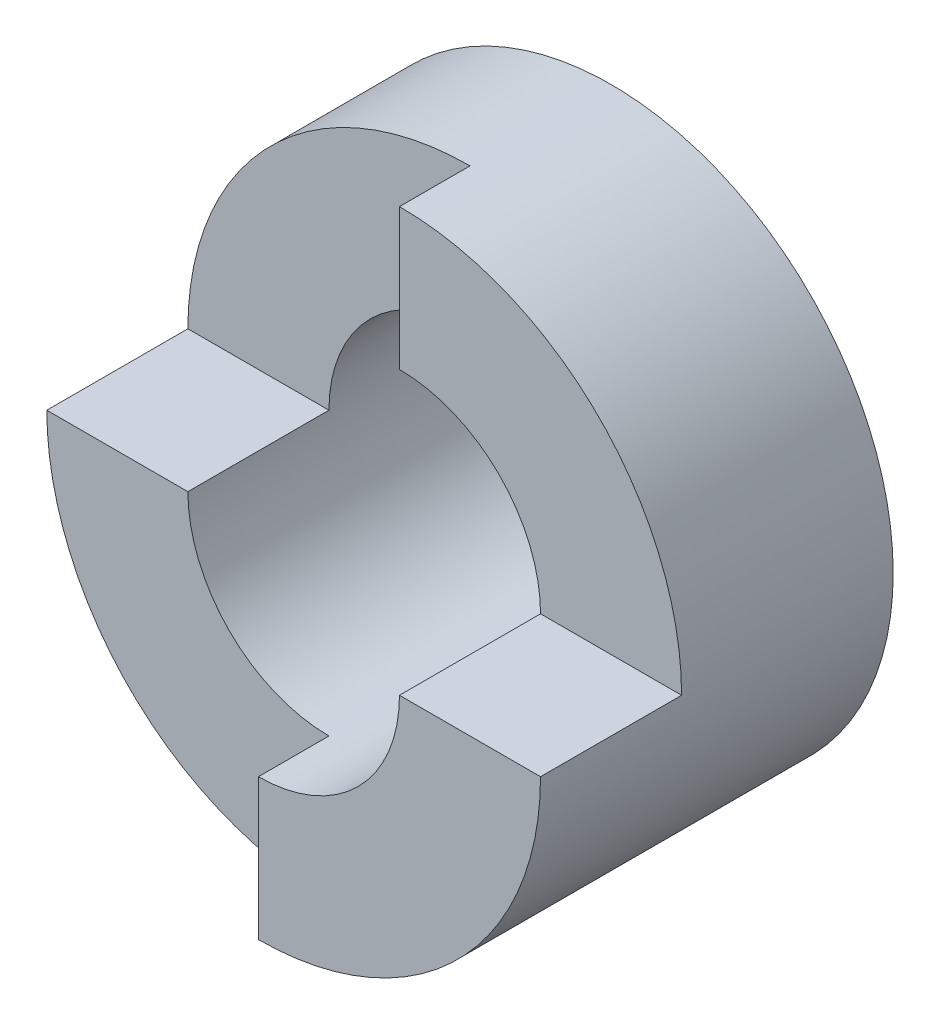
ISO-10303-21;
HEADER;
FILE_DESCRIPTION(('STEP AP214'),'2;1');
FILE_NAME('part.step','',(''),(''),'','','');
FILE_SCHEMA(('AUTOMOTIVE_DESIGN { 1 0 10303 214 1 1 1 1 }'));
ENDSEC;
DATA;
#1=APPLICATION_CONTEXT('core data for automotive mechanical design processes');
#2=APPLICATION_PROTOCOL_DEFINITION('international standard','automotive_design',2000,#1);
#3=PRODUCT_CONTEXT('',#1,'mechanical');
#4=PRODUCT('Part','Part','',(#3));
#5=PRODUCT_RELATED_PRODUCT_CATEGORY('part','',(#4));
#6=PRODUCT_DEFINITION_FORMATION('','',#4);
#7=PRODUCT_DEFINITION_CONTEXT('part definition',#1,'design');
#8=PRODUCT_DEFINITION('design','',#6,#7);
#9=PRODUCT_DEFINITION_SHAPE('','',#8);
#10=(LENGTH_UNIT() NAMED_UNIT(*) SI_UNIT(.MILLI.,.METRE.));
#11=(NAMED_UNIT(*) PLANE_ANGLE_UNIT() SI_UNIT($,.RADIAN.));
#12=(NAMED_UNIT(*) SI_UNIT($,.STERADIAN.) SOLID_ANGLE_UNIT());
#13=UNCERTAINTY_MEASURE_WITH_UNIT(LENGTH_MEASURE(1.E-05),#10,'distance_accuracy_value','');
#14=(GEOMETRIC_REPRESENTATION_CONTEXT(3) GLOBAL_UNCERTAINTY_ASSIGNED_CONTEXT((#13)) GLOBAL_UNIT_ASSIGNED_CONTEXT((#10,
#11,#12)) REPRESENTATION_CONTEXT('',''));
#15=CARTESIAN_POINT('',(0.,0.,0.));
#16=DIRECTION('',(0.,0.,1.));
#17=DIRECTION('',(1.,0.,0.));
#18=AXIS2_PLACEMENT_3D('',#15,#16,#17);
#19=CARTESIAN_POINT('',(0.,0.,5.));
#20=DIRECTION('',(0.,0.,1.));
#21=DIRECTION('',(1.,0.,0.));
#22=AXIS2_PLACEMENT_3D('',#19,#20,#21);
#23=PLANE('',#22);
#24=DIRECTION('',(0.,1.,0.));
#25=VECTOR('',#24,1.);
#26=CARTESIAN_POINT('',(0.,-5.,5.));
#27=LINE('',#26,#25);
#28=CARTESIAN_POINT('',(0.,-4.,5.));
#29=VERTEX_POINT('',#28);
#30=CARTESIAN_POINT('',(0.,-2.,5.));
#31=VERTEX_POINT('',#30);
#32=EDGE_CURVE('E180',#29,#31,#27,.T.);
#33=ORIENTED_EDGE('',*,*,#32,.F.);
#34=CARTESIAN_POINT('',(0.,0.,5.));
#35=DIRECTION('',(0.,0.,1.));
#36=DIRECTION('',(1.,0.,0.));
#37=AXIS2_PLACEMENT_3D('',#34,#35,#36);
#38=CIRCLE('',#37,4.);
#39=CARTESIAN_POINT('',(4.,0.,5.));
#40=VERTEX_POINT('',#39);
#41=EDGE_CURVE('E145',#29,#40,#38,.T.);
#42=ORIENTED_EDGE('',*,*,#41,.T.);
#43=DIRECTION('',(1.,0.,0.));
#44=VECTOR('',#43,1.);
#45=CARTESIAN_POINT('',(4.,0.,5.));
#46=LINE('',#45,#44);
#47=CARTESIAN_POINT('',(2.,0.,5.));
#48=VERTEX_POINT('',#47);
#49=EDGE_CURVE('E117',#48,#40,#46,.T.);
#50=ORIENTED_EDGE('',*,*,#49,.F.);
#51=CARTESIAN_POINT('',(0.,0.,5.));
#52=DIRECTION('',(0.,0.,1.));
#53=DIRECTION('',(1.,0.,0.));
#54=AXIS2_PLACEMENT_3D('',#51,#52,#53);
#55=CIRCLE('',#54,2.);
#56=EDGE_CURVE('E140',#31,#48,#55,.T.);
#57=ORIENTED_EDGE('',*,*,#56,.F.);
#58=EDGE_LOOP('',(#33,#42,#50,#57));
#59=FACE_BOUND('',#58,.T.);
#60=ADVANCED_FACE('F33',(#59),#23,.T.);
#61=CARTESIAN_POINT('',(0.,0.,0.));
#62=DIRECTION('',(0.,0.,1.));
#63=DIRECTION('',(1.,0.,0.));
#64=AXIS2_PLACEMENT_3D('',#61,#62,#63);
#65=PLANE('',#64);
#66=CARTESIAN_POINT('',(0.,0.,0.));
#67=DIRECTION('',(0.,0.,1.));
#68=DIRECTION('',(1.,0.,0.));
#69=AXIS2_PLACEMENT_3D('',#66,#67,#68);
#70=CIRCLE('',#69,4.);
#71=CARTESIAN_POINT('',(4.,0.,0.));
#72=VERTEX_POINT('',#71);
#73=EDGE_CURVE('E142',#72,#72,#70,.T.);
#74=ORIENTED_EDGE('',*,*,#73,.F.);
#75=EDGE_LOOP('',(#74));
#76=FACE_BOUND('',#75,.T.);
#77=CARTESIAN_POINT('',(0.,0.,0.));
#78=DIRECTION('',(0.,0.,1.));
#79=DIRECTION('',(1.,0.,0.));
#80=AXIS2_PLACEMENT_3D('',#77,#78,#79);
#81=CIRCLE('',#80,2.);
#82=CARTESIAN_POINT('',(2.,0.,0.));
#83=VERTEX_POINT('',#82);
#84=EDGE_CURVE('E139',#83,#83,#81,.T.);
#85=ORIENTED_EDGE('',*,*,#84,.T.);
#86=EDGE_LOOP('',(#85));
#87=FACE_BOUND('',#86,.T.);
#88=ADVANCED_FACE('F197',(#76,#87),#65,.F.);
#89=CARTESIAN_POINT('',(0.,0.,5.));
#90=DIRECTION('',(0.,0.,-1.));
#91=DIRECTION('',(-1.,0.,0.));
#92=AXIS2_PLACEMENT_3D('',#89,#90,#91);
#93=CYLINDRICAL_SURFACE('',#92,4.);
#94=DIRECTION('',(0.,0.,-1.));
#95=VECTOR('',#94,1.);
#96=CARTESIAN_POINT('',(0.,-4.,5.));
#97=LINE('',#96,#95);
#98=CARTESIAN_POINT('',(0.,-4.,4.));
#99=VERTEX_POINT('',#98);
#100=EDGE_CURVE('E111',#29,#99,#97,.T.);
#101=ORIENTED_EDGE('',*,*,#100,.T.);
#102=CARTESIAN_POINT('',(0.,0.,4.));
#103=DIRECTION('',(0.,0.,-1.));
#104=DIRECTION('',(-1.,0.,0.));
#105=AXIS2_PLACEMENT_3D('',#102,#103,#104);
#106=CIRCLE('',#105,4.);
#107=CARTESIAN_POINT('',(-4.,0.,4.));
#108=VERTEX_POINT('',#107);
#109=EDGE_CURVE('E98',#99,#108,#106,.T.);
#110=ORIENTED_EDGE('',*,*,#109,.T.);
#111=DIRECTION('',(0.,0.,1.));
#112=VECTOR('',#111,1.);
#113=CARTESIAN_POINT('',(-4.,0.,5.));
#114=LINE('',#113,#112);
#115=CARTESIAN_POINT('',(-4.,0.,2.));
#116=VERTEX_POINT('',#115);
#117=EDGE_CURVE('E109',#116,#108,#114,.T.);
#118=ORIENTED_EDGE('',*,*,#117,.F.);
#119=CARTESIAN_POINT('',(0.,0.,2.));
#120=DIRECTION('',(0.,0.,1.));
#121=DIRECTION('',(1.,0.,0.));
#122=AXIS2_PLACEMENT_3D('',#119,#120,#121);
#123=CIRCLE('',#122,4.);
#124=CARTESIAN_POINT('',(0.,4.,2.));
#125=VERTEX_POINT('',#124);
#126=EDGE_CURVE('E133',#125,#116,#123,.T.);
#127=ORIENTED_EDGE('',*,*,#126,.F.);
#128=DIRECTION('',(0.,0.,-1.));
#129=VECTOR('',#128,1.);
#130=CARTESIAN_POINT('',(0.,4.,5.));
#131=LINE('',#130,#129);
#132=CARTESIAN_POINT('',(0.,4.,3.));
#133=VERTEX_POINT('',#132);
#134=EDGE_CURVE('E135',#133,#125,#131,.T.);
#135=ORIENTED_EDGE('',*,*,#134,.F.);
#136=CARTESIAN_POINT('',(0.,0.,3.));
#137=DIRECTION('',(0.,0.,1.));
#138=DIRECTION('',(1.,0.,0.));
#139=AXIS2_PLACEMENT_3D('',#136,#137,#138);
#140=CIRCLE('',#139,4.);
#141=CARTESIAN_POINT('',(4.,0.,3.));
#142=VERTEX_POINT('',#141);
#143=EDGE_CURVE('E137',#142,#133,#140,.T.);
#144=ORIENTED_EDGE('',*,*,#143,.F.);
#145=DIRECTION('',(0.,0.,-1.));
#146=VECTOR('',#145,1.);
#147=CARTESIAN_POINT('',(4.,0.,3.));
#148=LINE('',#147,#146);
#149=EDGE_CURVE('E120',#40,#142,#148,.T.);
#150=ORIENTED_EDGE('',*,*,#149,.F.);
#151=ORIENTED_EDGE('',*,*,#41,.F.);
#152=EDGE_LOOP('',(#101,#110,#118,#127,#135,#144,#150,#151));
#153=FACE_BOUND('',#152,.T.);
#154=ORIENTED_EDGE('',*,*,#73,.T.);
#155=EDGE_LOOP('',(#154));
#156=FACE_BOUND('',#155,.T.);
#157=ADVANCED_FACE('F35',(#153,#156),#93,.T.);
#158=CARTESIAN_POINT('',(0.,0.,5.));
#159=DIRECTION('',(0.,0.,-1.));
#160=DIRECTION('',(-1.,0.,0.));
#161=AXIS2_PLACEMENT_3D('',#158,#159,#160);
#162=CYLINDRICAL_SURFACE('',#161,2.);
#163=CARTESIAN_POINT('',(0.,0.,4.));
#164=DIRECTION('',(0.,0.,-1.));
#165=DIRECTION('',(-1.,0.,0.));
#166=AXIS2_PLACEMENT_3D('',#163,#164,#165);
#167=CIRCLE('',#166,2.);
#168=CARTESIAN_POINT('',(0.,-2.,4.));
#169=VERTEX_POINT('',#168);
#170=CARTESIAN_POINT('',(-2.,0.,4.));
#171=VERTEX_POINT('',#170);
#172=EDGE_CURVE('E48',#169,#171,#167,.T.);
#173=ORIENTED_EDGE('',*,*,#172,.F.);
#174=DIRECTION('',(0.,0.,-1.));
#175=VECTOR('',#174,1.);
#176=CARTESIAN_POINT('',(0.,-2.,5.));
#177=LINE('',#176,#175);
#178=EDGE_CURVE('E11',#31,#169,#177,.T.);
#179=ORIENTED_EDGE('',*,*,#178,.F.);
#180=ORIENTED_EDGE('',*,*,#56,.T.);
#181=DIRECTION('',(0.,0.,-1.));
#182=VECTOR('',#181,1.);
#183=CARTESIAN_POINT('',(2.,0.,5.));
#184=LINE('',#183,#182);
#185=CARTESIAN_POINT('',(2.,0.,3.));
#186=VERTEX_POINT('',#185);
#187=EDGE_CURVE('E147',#186,#48,#184,.F.);
#188=ORIENTED_EDGE('',*,*,#187,.F.);
#189=CARTESIAN_POINT('',(0.,0.,3.));
#190=DIRECTION('',(0.,0.,1.));
#191=DIRECTION('',(1.,0.,0.));
#192=AXIS2_PLACEMENT_3D('',#189,#190,#191);
#193=CIRCLE('',#192,2.);
#194=CARTESIAN_POINT('',(0.,2.,3.));
#195=VERTEX_POINT('',#194);
#196=EDGE_CURVE('E151',#186,#195,#193,.T.);
#197=ORIENTED_EDGE('',*,*,#196,.T.);
#198=DIRECTION('',(0.,0.,-1.));
#199=VECTOR('',#198,1.);
#200=CARTESIAN_POINT('',(0.,2.,5.));
#201=LINE('',#200,#199);
#202=CARTESIAN_POINT('',(0.,2.,2.));
#203=VERTEX_POINT('',#202);
#204=EDGE_CURVE('E154',#195,#203,#201,.T.);
#205=ORIENTED_EDGE('',*,*,#204,.T.);
#206=CARTESIAN_POINT('',(0.,0.,2.));
#207=DIRECTION('',(0.,0.,1.));
#208=DIRECTION('',(1.,0.,0.));
#209=AXIS2_PLACEMENT_3D('',#206,#207,#208);
#210=CIRCLE('',#209,2.);
#211=CARTESIAN_POINT('',(-2.,0.,2.));
#212=VERTEX_POINT('',#211);
#213=EDGE_CURVE('E157',#203,#212,#210,.T.);
#214=ORIENTED_EDGE('',*,*,#213,.T.);
#215=DIRECTION('',(0.,0.,-1.));
#216=VECTOR('',#215,1.);
#217=CARTESIAN_POINT('',(-2.,0.,5.));
#218=LINE('',#217,#216);
#219=EDGE_CURVE('E103',#171,#212,#218,.T.);
#220=ORIENTED_EDGE('',*,*,#219,.F.);
#221=EDGE_LOOP('',(#173,#179,#180,#188,#197,#205,#214,#220));
#222=FACE_BOUND('',#221,.T.);
#223=ORIENTED_EDGE('',*,*,#84,.F.);
#224=EDGE_LOOP('',(#223));
#225=FACE_BOUND('',#224,.T.);
#226=ADVANCED_FACE('F164',(#222,#225),#162,.F.);
#227=CARTESIAN_POINT('',(0.,5.,3.));
#228=DIRECTION('',(0.,0.,1.));
#229=DIRECTION('',(1.,0.,0.));
#230=AXIS2_PLACEMENT_3D('',#227,#228,#229);
#231=PLANE('',#230);
#232=ORIENTED_EDGE('',*,*,#143,.T.);
#233=DIRECTION('',(0.,-1.,0.));
#234=VECTOR('',#233,1.);
#235=CARTESIAN_POINT('',(0.,5.,3.));
#236=LINE('',#235,#234);
#237=EDGE_CURVE('E130',#133,#195,#236,.T.);
#238=ORIENTED_EDGE('',*,*,#237,.T.);
#239=ORIENTED_EDGE('',*,*,#196,.F.);
#240=DIRECTION('',(-1.,0.,0.));
#241=VECTOR('',#240,1.);
#242=CARTESIAN_POINT('',(0.,0.,3.));
#243=LINE('',#242,#241);
#244=EDGE_CURVE('E56',#142,#186,#243,.T.);
#245=ORIENTED_EDGE('',*,*,#244,.F.);
#246=EDGE_LOOP('',(#232,#238,#239,#245));
#247=FACE_BOUND('',#246,.T.);
#248=ADVANCED_FACE('F172',(#247),#231,.T.);
#249=CARTESIAN_POINT('',(0.,5.,2.));
#250=DIRECTION('',(-1.,0.,0.));
#251=DIRECTION('',(0.,0.,1.));
#252=AXIS2_PLACEMENT_3D('',#249,#250,#251);
#253=PLANE('',#252);
#254=ORIENTED_EDGE('',*,*,#134,.T.);
#255=DIRECTION('',(0.,-1.,0.));
#256=VECTOR('',#255,1.);
#257=CARTESIAN_POINT('',(0.,5.,2.));
#258=LINE('',#257,#256);
#259=EDGE_CURVE('E127',#125,#203,#258,.T.);
#260=ORIENTED_EDGE('',*,*,#259,.T.);
#261=ORIENTED_EDGE('',*,*,#204,.F.);
#262=ORIENTED_EDGE('',*,*,#237,.F.);
#263=EDGE_LOOP('',(#254,#260,#261,#262));
#264=FACE_BOUND('',#263,.T.);
#265=ADVANCED_FACE('F169',(#264),#253,.T.);
#266=CARTESIAN_POINT('',(-4.,5.,2.));
#267=DIRECTION('',(0.,0.,1.));
#268=DIRECTION('',(1.,0.,0.));
#269=AXIS2_PLACEMENT_3D('',#266,#267,#268);
#270=PLANE('',#269);
#271=ORIENTED_EDGE('',*,*,#126,.T.);
#272=DIRECTION('',(-1.,0.,0.));
#273=VECTOR('',#272,1.);
#274=CARTESIAN_POINT('',(-4.,0.,2.));
#275=LINE('',#274,#273);
#276=EDGE_CURVE('E116',#212,#116,#275,.T.);
#277=ORIENTED_EDGE('',*,*,#276,.F.);
#278=ORIENTED_EDGE('',*,*,#213,.F.);
#279=ORIENTED_EDGE('',*,*,#259,.F.);
#280=EDGE_LOOP('',(#271,#277,#278,#279));
#281=FACE_BOUND('',#280,.T.);
#282=ADVANCED_FACE('F162',(#281),#270,.T.);
#283=CARTESIAN_POINT('',(0.,0.,0.));
#284=DIRECTION('',(0.,-1.,0.));
#285=DIRECTION('',(0.,0.,-1.));
#286=AXIS2_PLACEMENT_3D('',#283,#284,#285);
#287=PLANE('',#286);
#288=ORIENTED_EDGE('',*,*,#117,.T.);
#289=DIRECTION('',(1.,0.,0.));
#290=VECTOR('',#289,1.);
#291=CARTESIAN_POINT('',(0.,0.,4.));
#292=LINE('',#291,#290);
#293=EDGE_CURVE('E41',#108,#171,#292,.T.);
#294=ORIENTED_EDGE('',*,*,#293,.T.);
#295=ORIENTED_EDGE('',*,*,#219,.T.);
#296=ORIENTED_EDGE('',*,*,#276,.T.);
#297=EDGE_LOOP('',(#288,#294,#295,#296));
#298=FACE_BOUND('',#297,.T.);
#299=ADVANCED_FACE('F114',(#298),#287,.F.);
#300=ORIENTED_EDGE('',*,*,#187,.T.);
#301=ORIENTED_EDGE('',*,*,#49,.T.);
#302=ORIENTED_EDGE('',*,*,#149,.T.);
#303=ORIENTED_EDGE('',*,*,#244,.T.);
#304=EDGE_LOOP('',(#300,#301,#302,#303));
#305=FACE_BOUND('',#304,.T.);
#306=ADVANCED_FACE('F175',(#305),#287,.F.);
#307=CARTESIAN_POINT('',(0.,-5.,5.));
#308=DIRECTION('',(1.,0.,0.));
#309=DIRECTION('',(0.,0.,-1.));
#310=AXIS2_PLACEMENT_3D('',#307,#308,#309);
#311=PLANE('',#310);
#312=ORIENTED_EDGE('',*,*,#32,.T.);
#313=ORIENTED_EDGE('',*,*,#178,.T.);
#314=DIRECTION('',(0.,1.,0.));
#315=VECTOR('',#314,1.);
#316=CARTESIAN_POINT('',(0.,-5.,4.));
#317=LINE('',#316,#315);
#318=EDGE_CURVE('E183',#99,#169,#317,.T.);
#319=ORIENTED_EDGE('',*,*,#318,.F.);
#320=ORIENTED_EDGE('',*,*,#100,.F.);
#321=EDGE_LOOP('',(#312,#313,#319,#320));
#322=FACE_BOUND('',#321,.T.);
#323=ADVANCED_FACE('F187',(#322),#311,.F.);
#324=CARTESIAN_POINT('',(-4.,-5.,4.));
#325=DIRECTION('',(0.,0.,-1.));
#326=DIRECTION('',(-1.,0.,0.));
#327=AXIS2_PLACEMENT_3D('',#324,#325,#326);
#328=PLANE('',#327);
#329=ORIENTED_EDGE('',*,*,#318,.T.);
#330=ORIENTED_EDGE('',*,*,#172,.T.);
#331=ORIENTED_EDGE('',*,*,#293,.F.);
#332=ORIENTED_EDGE('',*,*,#109,.F.);
#333=EDGE_LOOP('',(#329,#330,#331,#332));
#334=FACE_BOUND('',#333,.T.);
#335=ADVANCED_FACE('F97',(#334),#328,.F.);
#336=CLOSED_SHELL('',(#60,#88,#157,#226,#248,#265,#282,#299,#306,#323,#335));
#337=MANIFOLD_SOLID_BREP('B2',#336);
#338=ADVANCED_BREP_SHAPE_REPRESENTATION('',(#18,#337),#14);
#339=SHAPE_DEFINITION_REPRESENTATION(#9,#338);
ENDSEC;
END-ISO-10303-21;
